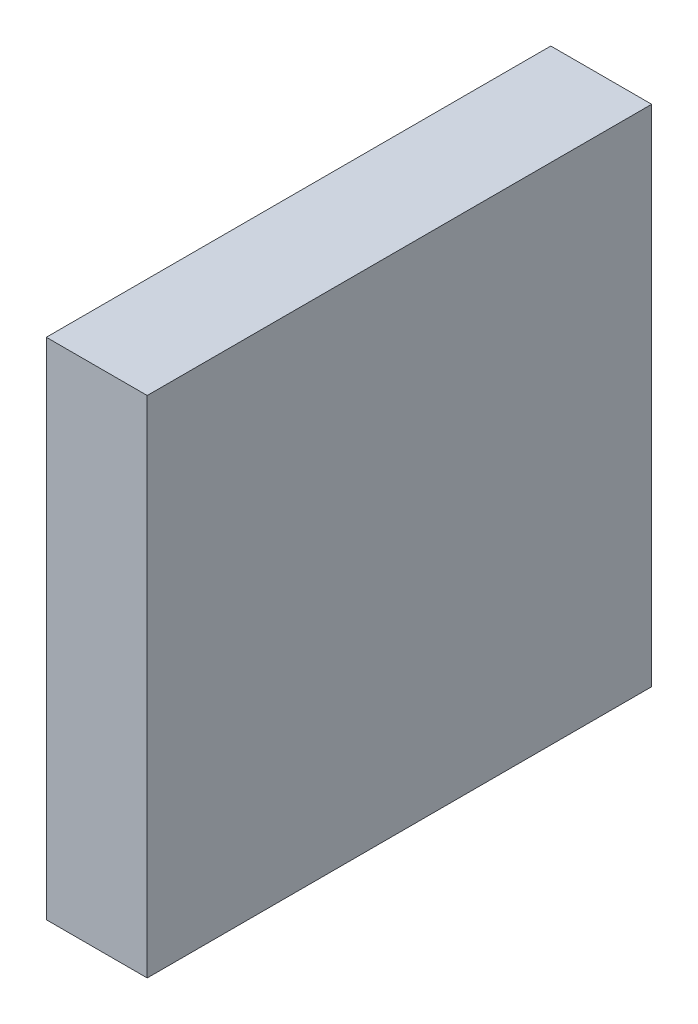
ISO-10303-21;
HEADER;
FILE_DESCRIPTION(('STEP AP214'),'2;1');
FILE_NAME('part.step','',(''),(''),'','','');
FILE_SCHEMA(('AUTOMOTIVE_DESIGN { 1 0 10303 214 1 1 1 1 }'));
ENDSEC;
DATA;
#1=APPLICATION_CONTEXT('core data for automotive mechanical design processes');
#2=APPLICATION_PROTOCOL_DEFINITION('international standard','automotive_design',2000,#1);
#3=PRODUCT_CONTEXT('',#1,'mechanical');
#4=PRODUCT('Part','Part','',(#3));
#5=PRODUCT_RELATED_PRODUCT_CATEGORY('part','',(#4));
#6=PRODUCT_DEFINITION_FORMATION('','',#4);
#7=PRODUCT_DEFINITION_CONTEXT('part definition',#1,'design');
#8=PRODUCT_DEFINITION('design','',#6,#7);
#9=PRODUCT_DEFINITION_SHAPE('','',#8);
#10=(LENGTH_UNIT() NAMED_UNIT(*) SI_UNIT(.MILLI.,.METRE.));
#11=(NAMED_UNIT(*) PLANE_ANGLE_UNIT() SI_UNIT($,.RADIAN.));
#12=(NAMED_UNIT(*) SI_UNIT($,.STERADIAN.) SOLID_ANGLE_UNIT());
#13=UNCERTAINTY_MEASURE_WITH_UNIT(LENGTH_MEASURE(1.E-05),#10,'distance_accuracy_value','');
#14=(GEOMETRIC_REPRESENTATION_CONTEXT(3) GLOBAL_UNCERTAINTY_ASSIGNED_CONTEXT((#13)) GLOBAL_UNIT_ASSIGNED_CONTEXT((#10,
#11,#12)) REPRESENTATION_CONTEXT('',''));
#15=CARTESIAN_POINT('',(0.,0.,0.));
#16=DIRECTION('',(0.,0.,1.));
#17=DIRECTION('',(1.,0.,0.));
#18=AXIS2_PLACEMENT_3D('',#15,#16,#17);
#19=CARTESIAN_POINT('',(0.5,-5.,2.5));
#20=DIRECTION('',(1.,0.,0.));
#21=DIRECTION('',(0.,0.,-1.));
#22=AXIS2_PLACEMENT_3D('',#19,#20,#21);
#23=PLANE('',#22);
#24=DIRECTION('',(0.,0.,-1.));
#25=VECTOR('',#24,1.);
#26=CARTESIAN_POINT('',(0.5,0.,2.5));
#27=LINE('',#26,#25);
#28=CARTESIAN_POINT('',(0.5,0.,2.5));
#29=VERTEX_POINT('',#28);
#30=CARTESIAN_POINT('',(0.5,0.,-2.5));
#31=VERTEX_POINT('',#30);
#32=EDGE_CURVE('E98',#29,#31,#27,.T.);
#33=ORIENTED_EDGE('',*,*,#32,.F.);
#34=DIRECTION('',(0.,1.,0.));
#35=VECTOR('',#34,1.);
#36=CARTESIAN_POINT('',(0.5,-5.,2.5));
#37=LINE('',#36,#35);
#38=CARTESIAN_POINT('',(0.5,-5.,2.5));
#39=VERTEX_POINT('',#38);
#40=EDGE_CURVE('E11',#39,#29,#37,.T.);
#41=ORIENTED_EDGE('',*,*,#40,.F.);
#42=DIRECTION('',(0.,0.,-1.));
#43=VECTOR('',#42,1.);
#44=CARTESIAN_POINT('',(0.5,-5.,2.5));
#45=LINE('',#44,#43);
#46=CARTESIAN_POINT('',(0.5,-5.,-2.5));
#47=VERTEX_POINT('',#46);
#48=EDGE_CURVE('E92',#39,#47,#45,.T.);
#49=ORIENTED_EDGE('',*,*,#48,.T.);
#50=DIRECTION('',(0.,1.,0.));
#51=VECTOR('',#50,1.);
#52=CARTESIAN_POINT('',(0.5,-5.,-2.5));
#53=LINE('',#52,#51);
#54=EDGE_CURVE('E37',#47,#31,#53,.T.);
#55=ORIENTED_EDGE('',*,*,#54,.T.);
#56=EDGE_LOOP('',(#33,#41,#49,#55));
#57=FACE_BOUND('',#56,.T.);
#58=ADVANCED_FACE('F34',(#57),#23,.T.);
#59=CARTESIAN_POINT('',(-0.5,-5.,2.5));
#60=DIRECTION('',(0.,0.,1.));
#61=DIRECTION('',(1.,0.,0.));
#62=AXIS2_PLACEMENT_3D('',#59,#60,#61);
#63=PLANE('',#62);
#64=DIRECTION('',(1.,0.,0.));
#65=VECTOR('',#64,1.);
#66=CARTESIAN_POINT('',(-0.5,0.,2.5));
#67=LINE('',#66,#65);
#68=CARTESIAN_POINT('',(-0.5,0.,2.5));
#69=VERTEX_POINT('',#68);
#70=EDGE_CURVE('E94',#69,#29,#67,.T.);
#71=ORIENTED_EDGE('',*,*,#70,.F.);
#72=DIRECTION('',(0.,1.,0.));
#73=VECTOR('',#72,1.);
#74=CARTESIAN_POINT('',(-0.5,-5.,2.5));
#75=LINE('',#74,#73);
#76=CARTESIAN_POINT('',(-0.5,-5.,2.5));
#77=VERTEX_POINT('',#76);
#78=EDGE_CURVE('E43',#77,#69,#75,.T.);
#79=ORIENTED_EDGE('',*,*,#78,.F.);
#80=DIRECTION('',(1.,0.,0.));
#81=VECTOR('',#80,1.);
#82=CARTESIAN_POINT('',(-0.5,-5.,2.5));
#83=LINE('',#82,#81);
#84=EDGE_CURVE('E89',#77,#39,#83,.T.);
#85=ORIENTED_EDGE('',*,*,#84,.T.);
#86=ORIENTED_EDGE('',*,*,#40,.T.);
#87=EDGE_LOOP('',(#71,#79,#85,#86));
#88=FACE_BOUND('',#87,.T.);
#89=ADVANCED_FACE('F108',(#88),#63,.T.);
#90=CARTESIAN_POINT('',(-0.5,-5.,2.5));
#91=DIRECTION('',(-1.,0.,0.));
#92=DIRECTION('',(0.,0.,1.));
#93=AXIS2_PLACEMENT_3D('',#90,#91,#92);
#94=PLANE('',#93);
#95=DIRECTION('',(0.,0.,1.));
#96=VECTOR('',#95,1.);
#97=CARTESIAN_POINT('',(-0.5,0.,2.5));
#98=LINE('',#97,#96);
#99=CARTESIAN_POINT('',(-0.5,0.,-2.5));
#100=VERTEX_POINT('',#99);
#101=EDGE_CURVE('E84',#100,#69,#98,.T.);
#102=ORIENTED_EDGE('',*,*,#101,.F.);
#103=DIRECTION('',(0.,1.,0.));
#104=VECTOR('',#103,1.);
#105=CARTESIAN_POINT('',(-0.5,-5.,-2.5));
#106=LINE('',#105,#104);
#107=CARTESIAN_POINT('',(-0.5,-5.,-2.5));
#108=VERTEX_POINT('',#107);
#109=EDGE_CURVE('E79',#108,#100,#106,.T.);
#110=ORIENTED_EDGE('',*,*,#109,.F.);
#111=DIRECTION('',(0.,0.,1.));
#112=VECTOR('',#111,1.);
#113=CARTESIAN_POINT('',(-0.5,-5.,2.5));
#114=LINE('',#113,#112);
#115=EDGE_CURVE('E82',#108,#77,#114,.T.);
#116=ORIENTED_EDGE('',*,*,#115,.T.);
#117=ORIENTED_EDGE('',*,*,#78,.T.);
#118=EDGE_LOOP('',(#102,#110,#116,#117));
#119=FACE_BOUND('',#118,.T.);
#120=ADVANCED_FACE('F81',(#119),#94,.T.);
#121=CARTESIAN_POINT('',(-0.5,-5.,-2.5));
#122=DIRECTION('',(0.,0.,-1.));
#123=DIRECTION('',(-1.,0.,0.));
#124=AXIS2_PLACEMENT_3D('',#121,#122,#123);
#125=PLANE('',#124);
#126=DIRECTION('',(-1.,0.,0.));
#127=VECTOR('',#126,1.);
#128=CARTESIAN_POINT('',(-0.5,0.,-2.5));
#129=LINE('',#128,#127);
#130=EDGE_CURVE('E101',#31,#100,#129,.T.);
#131=ORIENTED_EDGE('',*,*,#130,.F.);
#132=ORIENTED_EDGE('',*,*,#54,.F.);
#133=DIRECTION('',(-1.,0.,0.));
#134=VECTOR('',#133,1.);
#135=CARTESIAN_POINT('',(-0.5,-5.,-2.5));
#136=LINE('',#135,#134);
#137=EDGE_CURVE('E88',#47,#108,#136,.T.);
#138=ORIENTED_EDGE('',*,*,#137,.T.);
#139=ORIENTED_EDGE('',*,*,#109,.T.);
#140=EDGE_LOOP('',(#131,#132,#138,#139));
#141=FACE_BOUND('',#140,.T.);
#142=ADVANCED_FACE('F91',(#141),#125,.T.);
#143=CARTESIAN_POINT('',(0.,-5.,0.));
#144=DIRECTION('',(0.,-1.,0.));
#145=DIRECTION('',(0.,0.,-1.));
#146=AXIS2_PLACEMENT_3D('',#143,#144,#145);
#147=PLANE('',#146);
#148=ORIENTED_EDGE('',*,*,#48,.F.);
#149=ORIENTED_EDGE('',*,*,#84,.F.);
#150=ORIENTED_EDGE('',*,*,#115,.F.);
#151=ORIENTED_EDGE('',*,*,#137,.F.);
#152=EDGE_LOOP('',(#148,#149,#150,#151));
#153=FACE_BOUND('',#152,.T.);
#154=ADVANCED_FACE('F87',(#153),#147,.T.);
#155=CARTESIAN_POINT('',(0.,0.,0.));
#156=DIRECTION('',(0.,-1.,0.));
#157=DIRECTION('',(0.,0.,-1.));
#158=AXIS2_PLACEMENT_3D('',#155,#156,#157);
#159=PLANE('',#158);
#160=ORIENTED_EDGE('',*,*,#32,.T.);
#161=ORIENTED_EDGE('',*,*,#130,.T.);
#162=ORIENTED_EDGE('',*,*,#101,.T.);
#163=ORIENTED_EDGE('',*,*,#70,.T.);
#164=EDGE_LOOP('',(#160,#161,#162,#163));
#165=FACE_BOUND('',#164,.T.);
#166=ADVANCED_FACE('F107',(#165),#159,.F.);
#167=CLOSED_SHELL('',(#58,#89,#120,#142,#154,#166));
#168=MANIFOLD_SOLID_BREP('B2',#167);
#169=ADVANCED_BREP_SHAPE_REPRESENTATION('',(#18,#168),#14);
#170=SHAPE_DEFINITION_REPRESENTATION(#9,#169);
ENDSEC;
END-ISO-10303-21;
